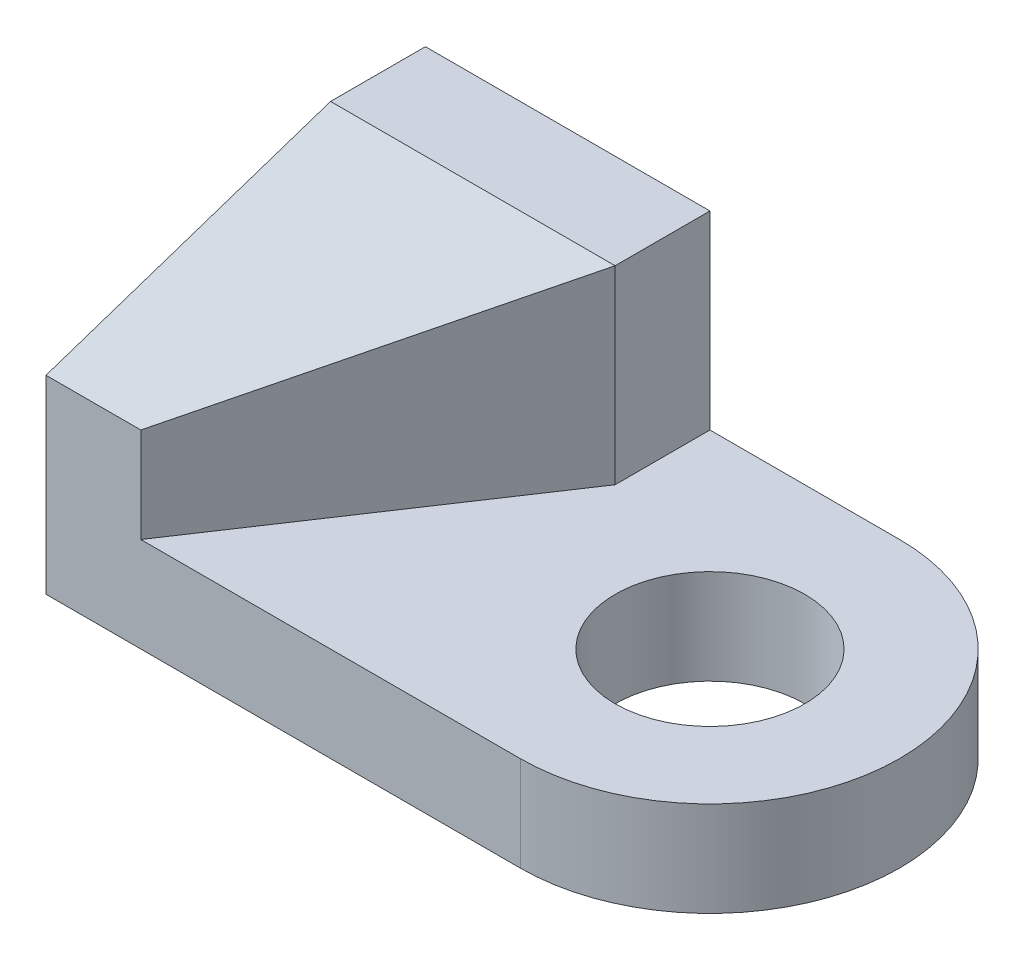
ISO-10303-21;
HEADER;
FILE_DESCRIPTION(('STEP AP214'),'2;1');
FILE_NAME('part.step','',(''),(''),'','','');
FILE_SCHEMA(('AUTOMOTIVE_DESIGN { 1 0 10303 214 1 1 1 1 }'));
ENDSEC;
DATA;
#1=APPLICATION_CONTEXT('core data for automotive mechanical design processes');
#2=APPLICATION_PROTOCOL_DEFINITION('international standard','automotive_design',2000,#1);
#3=PRODUCT_CONTEXT('',#1,'mechanical');
#4=PRODUCT('Part','Part','',(#3));
#5=PRODUCT_RELATED_PRODUCT_CATEGORY('part','',(#4));
#6=PRODUCT_DEFINITION_FORMATION('','',#4);
#7=PRODUCT_DEFINITION_CONTEXT('part definition',#1,'design');
#8=PRODUCT_DEFINITION('design','',#6,#7);
#9=PRODUCT_DEFINITION_SHAPE('','',#8);
#10=(LENGTH_UNIT() NAMED_UNIT(*) SI_UNIT(.MILLI.,.METRE.));
#11=(NAMED_UNIT(*) PLANE_ANGLE_UNIT() SI_UNIT($,.RADIAN.));
#12=(NAMED_UNIT(*) SI_UNIT($,.STERADIAN.) SOLID_ANGLE_UNIT());
#13=UNCERTAINTY_MEASURE_WITH_UNIT(LENGTH_MEASURE(1.E-05),#10,'distance_accuracy_value','');
#14=(GEOMETRIC_REPRESENTATION_CONTEXT(3) GLOBAL_UNCERTAINTY_ASSIGNED_CONTEXT((#13)) GLOBAL_UNIT_ASSIGNED_CONTEXT((#10,
#11,#12)) REPRESENTATION_CONTEXT('',''));
#15=CARTESIAN_POINT('',(0.,0.,0.));
#16=DIRECTION('',(0.,0.,1.));
#17=DIRECTION('',(1.,0.,0.));
#18=AXIS2_PLACEMENT_3D('',#15,#16,#17);
#19=CARTESIAN_POINT('',(0.,5.,10.));
#20=DIRECTION('',(0.,0.,-1.));
#21=DIRECTION('',(-1.,0.,0.));
#22=AXIS2_PLACEMENT_3D('',#19,#20,#21);
#23=PLANE('',#22);
#24=DIRECTION('',(1.,0.,0.));
#25=VECTOR('',#24,1.);
#26=CARTESIAN_POINT('',(0.,5.,10.));
#27=LINE('',#26,#25);
#28=CARTESIAN_POINT('',(-20.,5.,10.));
#29=VERTEX_POINT('',#28);
#30=CARTESIAN_POINT('',(0.,5.,10.));
#31=VERTEX_POINT('',#30);
#32=EDGE_CURVE('E104',#29,#31,#27,.T.);
#33=ORIENTED_EDGE('',*,*,#32,.F.);
#34=DIRECTION('',(0.,1.,0.));
#35=VECTOR('',#34,1.);
#36=CARTESIAN_POINT('',(-20.,5.,10.));
#37=LINE('',#36,#35);
#38=CARTESIAN_POINT('',(-20.,10.,10.));
#39=VERTEX_POINT('',#38);
#40=EDGE_CURVE('E142',#29,#39,#37,.T.);
#41=ORIENTED_EDGE('',*,*,#40,.T.);
#42=DIRECTION('',(1.,0.,0.));
#43=VECTOR('',#42,1.);
#44=CARTESIAN_POINT('',(-25.,10.,10.));
#45=LINE('',#44,#43);
#46=CARTESIAN_POINT('',(-25.,10.,10.));
#47=VERTEX_POINT('',#46);
#48=EDGE_CURVE('E134',#47,#39,#45,.T.);
#49=ORIENTED_EDGE('',*,*,#48,.F.);
#50=DIRECTION('',(0.,-1.,0.));
#51=VECTOR('',#50,1.);
#52=CARTESIAN_POINT('',(-25.,15.,10.));
#53=LINE('',#52,#51);
#54=CARTESIAN_POINT('',(-25.,0.,10.));
#55=VERTEX_POINT('',#54);
#56=EDGE_CURVE('E120',#47,#55,#53,.T.);
#57=ORIENTED_EDGE('',*,*,#56,.T.);
#58=DIRECTION('',(1.,0.,0.));
#59=VECTOR('',#58,1.);
#60=CARTESIAN_POINT('',(0.,0.,10.));
#61=LINE('',#60,#59);
#62=CARTESIAN_POINT('',(0.,0.,10.));
#63=VERTEX_POINT('',#62);
#64=EDGE_CURVE('E85',#55,#63,#61,.T.);
#65=ORIENTED_EDGE('',*,*,#64,.T.);
#66=DIRECTION('',(0.,-1.,0.));
#67=VECTOR('',#66,1.);
#68=CARTESIAN_POINT('',(0.,5.,10.));
#69=LINE('',#68,#67);
#70=EDGE_CURVE('E47',#31,#63,#69,.T.);
#71=ORIENTED_EDGE('',*,*,#70,.F.);
#72=EDGE_LOOP('',(#33,#41,#49,#57,#65,#71));
#73=FACE_BOUND('',#72,.T.);
#74=ADVANCED_FACE('F39',(#73),#23,.F.);
#75=CARTESIAN_POINT('',(0.,5.,0.));
#76=DIRECTION('',(0.,-1.,0.));
#77=DIRECTION('',(0.,0.,-1.));
#78=AXIS2_PLACEMENT_3D('',#75,#76,#77);
#79=CYLINDRICAL_SURFACE('',#78,10.);
#80=CARTESIAN_POINT('',(0.,0.,0.));
#81=DIRECTION('',(0.,1.,0.));
#82=DIRECTION('',(0.,0.,1.));
#83=AXIS2_PLACEMENT_3D('',#80,#81,#82);
#84=CIRCLE('',#83,10.);
#85=CARTESIAN_POINT('',(0.,0.,-10.));
#86=VERTEX_POINT('',#85);
#87=EDGE_CURVE('E74',#63,#86,#84,.T.);
#88=ORIENTED_EDGE('',*,*,#87,.T.);
#89=DIRECTION('',(0.,-1.,0.));
#90=VECTOR('',#89,1.);
#91=CARTESIAN_POINT('',(0.,5.,-10.));
#92=LINE('',#91,#90);
#93=CARTESIAN_POINT('',(0.,5.,-10.));
#94=VERTEX_POINT('',#93);
#95=EDGE_CURVE('E77',#94,#86,#92,.T.);
#96=ORIENTED_EDGE('',*,*,#95,.F.);
#97=CARTESIAN_POINT('',(0.,5.,0.));
#98=DIRECTION('',(0.,1.,0.));
#99=DIRECTION('',(0.,0.,1.));
#100=AXIS2_PLACEMENT_3D('',#97,#98,#99);
#101=CIRCLE('',#100,10.);
#102=EDGE_CURVE('E62',#31,#94,#101,.T.);
#103=ORIENTED_EDGE('',*,*,#102,.F.);
#104=ORIENTED_EDGE('',*,*,#70,.T.);
#105=EDGE_LOOP('',(#88,#96,#103,#104));
#106=FACE_BOUND('',#105,.T.);
#107=ADVANCED_FACE('F76',(#106),#79,.T.);
#108=CARTESIAN_POINT('',(0.,5.,-10.));
#109=DIRECTION('',(0.,0.,1.));
#110=DIRECTION('',(1.,0.,0.));
#111=AXIS2_PLACEMENT_3D('',#108,#109,#110);
#112=PLANE('',#111);
#113=DIRECTION('',(-1.,0.,0.));
#114=VECTOR('',#113,1.);
#115=CARTESIAN_POINT('',(0.,0.,-10.));
#116=LINE('',#115,#114);
#117=CARTESIAN_POINT('',(-25.,0.,-10.));
#118=VERTEX_POINT('',#117);
#119=EDGE_CURVE('E84',#86,#118,#116,.T.);
#120=ORIENTED_EDGE('',*,*,#119,.T.);
#121=DIRECTION('',(0.,-1.,0.));
#122=VECTOR('',#121,1.);
#123=CARTESIAN_POINT('',(-25.,15.,-10.));
#124=LINE('',#123,#122);
#125=CARTESIAN_POINT('',(-25.,15.,-10.));
#126=VERTEX_POINT('',#125);
#127=EDGE_CURVE('E118',#126,#118,#124,.T.);
#128=ORIENTED_EDGE('',*,*,#127,.F.);
#129=DIRECTION('',(-1.,0.,0.));
#130=VECTOR('',#129,1.);
#131=CARTESIAN_POINT('',(0.,15.,-10.));
#132=LINE('',#131,#130);
#133=CARTESIAN_POINT('',(-10.,15.,-10.));
#134=VERTEX_POINT('',#133);
#135=EDGE_CURVE('E129',#134,#126,#132,.T.);
#136=ORIENTED_EDGE('',*,*,#135,.F.);
#137=DIRECTION('',(0.,-1.,0.));
#138=VECTOR('',#137,1.);
#139=CARTESIAN_POINT('',(-10.,15.,-10.));
#140=LINE('',#139,#138);
#141=CARTESIAN_POINT('',(-10.,5.,-10.));
#142=VERTEX_POINT('',#141);
#143=EDGE_CURVE('E111',#134,#142,#140,.T.);
#144=ORIENTED_EDGE('',*,*,#143,.T.);
#145=DIRECTION('',(-1.,0.,0.));
#146=VECTOR('',#145,1.);
#147=CARTESIAN_POINT('',(0.,5.,-10.));
#148=LINE('',#147,#146);
#149=EDGE_CURVE('E94',#94,#142,#148,.T.);
#150=ORIENTED_EDGE('',*,*,#149,.F.);
#151=ORIENTED_EDGE('',*,*,#95,.T.);
#152=EDGE_LOOP('',(#120,#128,#136,#144,#150,#151));
#153=FACE_BOUND('',#152,.T.);
#154=ADVANCED_FACE('F89',(#153),#112,.F.);
#155=CARTESIAN_POINT('',(0.,5.,0.));
#156=DIRECTION('',(0.,-1.,0.));
#157=DIRECTION('',(0.,0.,-1.));
#158=AXIS2_PLACEMENT_3D('',#155,#156,#157);
#159=CYLINDRICAL_SURFACE('',#158,5.);
#160=CARTESIAN_POINT('',(0.,5.,0.));
#161=DIRECTION('',(0.,1.,0.));
#162=DIRECTION('',(0.,0.,1.));
#163=AXIS2_PLACEMENT_3D('',#160,#161,#162);
#164=CIRCLE('',#163,5.);
#165=CARTESIAN_POINT('',(0.,5.,5.));
#166=VERTEX_POINT('',#165);
#167=EDGE_CURVE('E101',#166,#166,#164,.T.);
#168=ORIENTED_EDGE('',*,*,#167,.T.);
#169=EDGE_LOOP('',(#168));
#170=FACE_BOUND('',#169,.T.);
#171=CARTESIAN_POINT('',(0.,0.,0.));
#172=DIRECTION('',(0.,1.,0.));
#173=DIRECTION('',(0.,0.,1.));
#174=AXIS2_PLACEMENT_3D('',#171,#172,#173);
#175=CIRCLE('',#174,5.);
#176=CARTESIAN_POINT('',(0.,0.,5.));
#177=VERTEX_POINT('',#176);
#178=EDGE_CURVE('E108',#177,#177,#175,.T.);
#179=ORIENTED_EDGE('',*,*,#178,.F.);
#180=EDGE_LOOP('',(#179));
#181=FACE_BOUND('',#180,.T.);
#182=ADVANCED_FACE('F41',(#170,#181),#159,.F.);
#183=CARTESIAN_POINT('',(0.,5.,0.));
#184=DIRECTION('',(0.,1.,0.));
#185=DIRECTION('',(0.,0.,1.));
#186=AXIS2_PLACEMENT_3D('',#183,#184,#185);
#187=PLANE('',#186);
#188=ORIENTED_EDGE('',*,*,#167,.F.);
#189=EDGE_LOOP('',(#188));
#190=FACE_BOUND('',#189,.T.);
#191=ORIENTED_EDGE('',*,*,#32,.T.);
#192=ORIENTED_EDGE('',*,*,#102,.T.);
#193=ORIENTED_EDGE('',*,*,#149,.T.);
#194=DIRECTION('',(0.,0.,1.));
#195=VECTOR('',#194,1.);
#196=CARTESIAN_POINT('',(-10.,5.,0.));
#197=LINE('',#196,#195);
#198=CARTESIAN_POINT('',(-10.,5.,-5.));
#199=VERTEX_POINT('',#198);
#200=EDGE_CURVE('E95',#142,#199,#197,.T.);
#201=ORIENTED_EDGE('',*,*,#200,.T.);
#202=DIRECTION('',(-0.554700196225229,0.,0.832050294337844));
#203=VECTOR('',#202,1.);
#204=CARTESIAN_POINT('',(-10.,5.,-5.));
#205=LINE('',#204,#203);
#206=EDGE_CURVE('E144',#199,#29,#205,.T.);
#207=ORIENTED_EDGE('',*,*,#206,.T.);
#208=EDGE_LOOP('',(#191,#192,#193,#201,#207));
#209=FACE_BOUND('',#208,.T.);
#210=ADVANCED_FACE('F149',(#190,#209),#187,.T.);
#211=CARTESIAN_POINT('',(0.,0.,0.));
#212=DIRECTION('',(0.,1.,0.));
#213=DIRECTION('',(0.,0.,1.));
#214=AXIS2_PLACEMENT_3D('',#211,#212,#213);
#215=PLANE('',#214);
#216=ORIENTED_EDGE('',*,*,#178,.T.);
#217=EDGE_LOOP('',(#216));
#218=FACE_BOUND('',#217,.T.);
#219=ORIENTED_EDGE('',*,*,#64,.F.);
#220=DIRECTION('',(0.,0.,1.));
#221=VECTOR('',#220,1.);
#222=CARTESIAN_POINT('',(-25.,0.,0.));
#223=LINE('',#222,#221);
#224=EDGE_CURVE('E100',#118,#55,#223,.T.);
#225=ORIENTED_EDGE('',*,*,#224,.F.);
#226=ORIENTED_EDGE('',*,*,#119,.F.);
#227=ORIENTED_EDGE('',*,*,#87,.F.);
#228=EDGE_LOOP('',(#219,#225,#226,#227));
#229=FACE_BOUND('',#228,.T.);
#230=ADVANCED_FACE('F98',(#218,#229),#215,.F.);
#231=CARTESIAN_POINT('',(-10.,15.,0.));
#232=DIRECTION('',(1.,0.,0.));
#233=DIRECTION('',(0.,0.,-1.));
#234=AXIS2_PLACEMENT_3D('',#231,#232,#233);
#235=PLANE('',#234);
#236=DIRECTION('',(0.,1.,0.));
#237=VECTOR('',#236,1.);
#238=CARTESIAN_POINT('',(-10.,5.,-5.));
#239=LINE('',#238,#237);
#240=CARTESIAN_POINT('',(-10.,15.,-5.));
#241=VERTEX_POINT('',#240);
#242=EDGE_CURVE('E54',#199,#241,#239,.T.);
#243=ORIENTED_EDGE('',*,*,#242,.F.);
#244=ORIENTED_EDGE('',*,*,#200,.F.);
#245=ORIENTED_EDGE('',*,*,#143,.F.);
#246=DIRECTION('',(0.,0.,1.));
#247=VECTOR('',#246,1.);
#248=CARTESIAN_POINT('',(-10.,15.,0.));
#249=LINE('',#248,#247);
#250=EDGE_CURVE('E125',#134,#241,#249,.T.);
#251=ORIENTED_EDGE('',*,*,#250,.T.);
#252=EDGE_LOOP('',(#243,#244,#245,#251));
#253=FACE_BOUND('',#252,.T.);
#254=ADVANCED_FACE('F159',(#253),#235,.T.);
#255=CARTESIAN_POINT('',(-25.,15.,0.));
#256=DIRECTION('',(1.,0.,0.));
#257=DIRECTION('',(0.,0.,-1.));
#258=AXIS2_PLACEMENT_3D('',#255,#256,#257);
#259=PLANE('',#258);
#260=ORIENTED_EDGE('',*,*,#56,.F.);
#261=DIRECTION('',(0.,0.316227766016838,-0.948683298050514));
#262=VECTOR('',#261,1.);
#263=CARTESIAN_POINT('',(-25.,15.,-5.));
#264=LINE('',#263,#262);
#265=CARTESIAN_POINT('',(-25.,15.,-5.));
#266=VERTEX_POINT('',#265);
#267=EDGE_CURVE('E137',#47,#266,#264,.T.);
#268=ORIENTED_EDGE('',*,*,#267,.T.);
#269=DIRECTION('',(0.,0.,1.));
#270=VECTOR('',#269,1.);
#271=CARTESIAN_POINT('',(-25.,15.,0.));
#272=LINE('',#271,#270);
#273=EDGE_CURVE('E123',#126,#266,#272,.T.);
#274=ORIENTED_EDGE('',*,*,#273,.F.);
#275=ORIENTED_EDGE('',*,*,#127,.T.);
#276=ORIENTED_EDGE('',*,*,#224,.T.);
#277=EDGE_LOOP('',(#260,#268,#274,#275,#276));
#278=FACE_BOUND('',#277,.T.);
#279=ADVANCED_FACE('F191',(#278),#259,.F.);
#280=CARTESIAN_POINT('',(0.,15.,0.));
#281=DIRECTION('',(0.,1.,0.));
#282=DIRECTION('',(0.,0.,1.));
#283=AXIS2_PLACEMENT_3D('',#280,#281,#282);
#284=PLANE('',#283);
#285=DIRECTION('',(1.,0.,0.));
#286=VECTOR('',#285,1.);
#287=CARTESIAN_POINT('',(-25.,15.,-5.));
#288=LINE('',#287,#286);
#289=EDGE_CURVE('E126',#266,#241,#288,.T.);
#290=ORIENTED_EDGE('',*,*,#289,.T.);
#291=ORIENTED_EDGE('',*,*,#250,.F.);
#292=ORIENTED_EDGE('',*,*,#135,.T.);
#293=ORIENTED_EDGE('',*,*,#273,.T.);
#294=EDGE_LOOP('',(#290,#291,#292,#293));
#295=FACE_BOUND('',#294,.T.);
#296=ADVANCED_FACE('F165',(#295),#284,.T.);
#297=CARTESIAN_POINT('',(-25.,15.,-5.));
#298=DIRECTION('',(0.,-0.948683298050514,-0.316227766016838));
#299=DIRECTION('',(0.,0.316227766016838,-0.948683298050514));
#300=AXIS2_PLACEMENT_3D('',#297,#298,#299);
#301=PLANE('',#300);
#302=ORIENTED_EDGE('',*,*,#48,.T.);
#303=DIRECTION('',(0.534522483824849,0.267261241912424,-0.801783725737273));
#304=VECTOR('',#303,1.);
#305=CARTESIAN_POINT('',(-14.2857142857143,12.8571428571429,1.42857142857143));
#306=LINE('',#305,#304);
#307=EDGE_CURVE('E11',#39,#241,#306,.T.);
#308=ORIENTED_EDGE('',*,*,#307,.T.);
#309=ORIENTED_EDGE('',*,*,#289,.F.);
#310=ORIENTED_EDGE('',*,*,#267,.F.);
#311=EDGE_LOOP('',(#302,#308,#309,#310));
#312=FACE_BOUND('',#311,.T.);
#313=ADVANCED_FACE('F183',(#312),#301,.F.);
#314=CARTESIAN_POINT('',(-10.,5.,-5.));
#315=DIRECTION('',(-0.832050294337844,0.,-0.554700196225229));
#316=DIRECTION('',(-0.554700196225229,0.,0.832050294337844));
#317=AXIS2_PLACEMENT_3D('',#314,#315,#316);
#318=PLANE('',#317);
#319=ORIENTED_EDGE('',*,*,#40,.F.);
#320=ORIENTED_EDGE('',*,*,#206,.F.);
#321=ORIENTED_EDGE('',*,*,#242,.T.);
#322=ORIENTED_EDGE('',*,*,#307,.F.);
#323=EDGE_LOOP('',(#319,#320,#321,#322));
#324=FACE_BOUND('',#323,.T.);
#325=ADVANCED_FACE('F156',(#324),#318,.F.);
#326=CLOSED_SHELL('',(#74,#107,#154,#182,#210,#230,#254,#279,#296,#313,#325));
#327=MANIFOLD_SOLID_BREP('B2',#326);
#328=ADVANCED_BREP_SHAPE_REPRESENTATION('',(#18,#327),#14);
#329=SHAPE_DEFINITION_REPRESENTATION(#9,#328);
ENDSEC;
END-ISO-10303-21;
